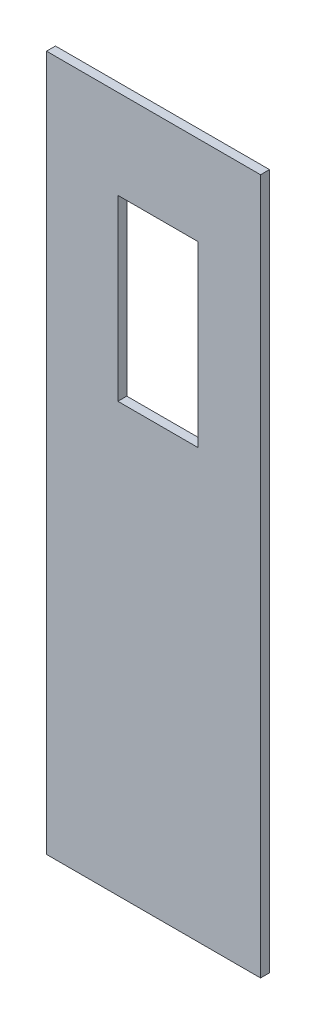
ISO-10303-21;
HEADER;
FILE_DESCRIPTION(('STEP AP214'),'2;1');
FILE_NAME('part.step','',(''),(''),'','','');
FILE_SCHEMA(('AUTOMOTIVE_DESIGN { 1 0 10303 214 1 1 1 1 }'));
ENDSEC;
DATA;
#1=APPLICATION_CONTEXT('core data for automotive mechanical design processes');
#2=APPLICATION_PROTOCOL_DEFINITION('international standard','automotive_design',2000,#1);
#3=PRODUCT_CONTEXT('',#1,'mechanical');
#4=PRODUCT('Part','Part','',(#3));
#5=PRODUCT_RELATED_PRODUCT_CATEGORY('part','',(#4));
#6=PRODUCT_DEFINITION_FORMATION('','',#4);
#7=PRODUCT_DEFINITION_CONTEXT('part definition',#1,'design');
#8=PRODUCT_DEFINITION('design','',#6,#7);
#9=PRODUCT_DEFINITION_SHAPE('','',#8);
#10=(LENGTH_UNIT() NAMED_UNIT(*) SI_UNIT(.MILLI.,.METRE.));
#11=(NAMED_UNIT(*) PLANE_ANGLE_UNIT() SI_UNIT($,.RADIAN.));
#12=(NAMED_UNIT(*) SI_UNIT($,.STERADIAN.) SOLID_ANGLE_UNIT());
#13=UNCERTAINTY_MEASURE_WITH_UNIT(LENGTH_MEASURE(1.E-05),#10,'distance_accuracy_value','');
#14=(GEOMETRIC_REPRESENTATION_CONTEXT(3) GLOBAL_UNCERTAINTY_ASSIGNED_CONTEXT((#13)) GLOBAL_UNIT_ASSIGNED_CONTEXT((#10,
#11,#12)) REPRESENTATION_CONTEXT('',''));
#15=CARTESIAN_POINT('',(0.,0.,0.));
#16=DIRECTION('',(0.,0.,1.));
#17=DIRECTION('',(1.,0.,0.));
#18=AXIS2_PLACEMENT_3D('',#15,#16,#17);
#19=CARTESIAN_POINT('',(0.,0.,5.));
#20=DIRECTION('',(0.,0.,1.));
#21=DIRECTION('',(1.,0.,0.));
#22=AXIS2_PLACEMENT_3D('',#19,#20,#21);
#23=PLANE('',#22);
#24=DIRECTION('',(0.,-1.,0.));
#25=VECTOR('',#24,1.);
#26=CARTESIAN_POINT('',(-61.0528045896396,64.6213031662228,5.));
#27=LINE('',#26,#25);
#28=CARTESIAN_POINT('',(-61.0528045896396,64.6213031662228,5.));
#29=VERTEX_POINT('',#28);
#30=CARTESIAN_POINT('',(-61.0528045896396,-325.378696833777,5.));
#31=VERTEX_POINT('',#30);
#32=EDGE_CURVE('E134',#29,#31,#27,.T.);
#33=ORIENTED_EDGE('',*,*,#32,.T.);
#34=DIRECTION('',(1.,0.,0.));
#35=VECTOR('',#34,1.);
#36=CARTESIAN_POINT('',(-61.0528045896396,-325.378696833777,5.));
#37=LINE('',#36,#35);
#38=CARTESIAN_POINT('',(58.9471954103604,-325.378696833777,5.));
#39=VERTEX_POINT('',#38);
#40=EDGE_CURVE('E137',#31,#39,#37,.T.);
#41=ORIENTED_EDGE('',*,*,#40,.T.);
#42=DIRECTION('',(0.,1.,0.));
#43=VECTOR('',#42,1.);
#44=CARTESIAN_POINT('',(58.9471954103604,64.6213031662228,5.));
#45=LINE('',#44,#43);
#46=CARTESIAN_POINT('',(58.9471954103604,64.6213031662228,5.));
#47=VERTEX_POINT('',#46);
#48=EDGE_CURVE('E140',#39,#47,#45,.T.);
#49=ORIENTED_EDGE('',*,*,#48,.T.);
#50=DIRECTION('',(-1.,0.,0.));
#51=VECTOR('',#50,1.);
#52=CARTESIAN_POINT('',(-61.0528045896396,64.6213031662228,5.));
#53=LINE('',#52,#51);
#54=EDGE_CURVE('E142',#47,#29,#53,.T.);
#55=ORIENTED_EDGE('',*,*,#54,.T.);
#56=EDGE_LOOP('',(#33,#41,#49,#55));
#57=FACE_BOUND('',#56,.T.);
#58=DIRECTION('',(1.,0.,0.));
#59=VECTOR('',#58,1.);
#60=CARTESIAN_POINT('',(-21.0528045896396,-85.3786968337772,5.));
#61=LINE('',#60,#59);
#62=CARTESIAN_POINT('',(-21.0528045896396,-85.3786968337772,5.));
#63=VERTEX_POINT('',#62);
#64=CARTESIAN_POINT('',(23.9471954103604,-85.3786968337772,5.));
#65=VERTEX_POINT('',#64);
#66=EDGE_CURVE('E106',#63,#65,#61,.T.);
#67=ORIENTED_EDGE('',*,*,#66,.F.);
#68=DIRECTION('',(0.,-1.,0.));
#69=VECTOR('',#68,1.);
#70=CARTESIAN_POINT('',(-21.0528045896396,-85.3786968337772,5.));
#71=LINE('',#70,#69);
#72=CARTESIAN_POINT('',(-21.0528045896396,14.6213031662228,5.));
#73=VERTEX_POINT('',#72);
#74=EDGE_CURVE('E98',#73,#63,#71,.T.);
#75=ORIENTED_EDGE('',*,*,#74,.F.);
#76=DIRECTION('',(-1.,0.,0.));
#77=VECTOR('',#76,1.);
#78=CARTESIAN_POINT('',(-21.0528045896396,14.6213031662228,5.));
#79=LINE('',#78,#77);
#80=CARTESIAN_POINT('',(23.9471954103604,14.6213031662228,5.));
#81=VERTEX_POINT('',#80);
#82=EDGE_CURVE('E120',#81,#73,#79,.T.);
#83=ORIENTED_EDGE('',*,*,#82,.F.);
#84=DIRECTION('',(0.,1.,0.));
#85=VECTOR('',#84,1.);
#86=CARTESIAN_POINT('',(23.9471954103604,-85.3786968337772,5.));
#87=LINE('',#86,#85);
#88=EDGE_CURVE('E118',#65,#81,#87,.T.);
#89=ORIENTED_EDGE('',*,*,#88,.F.);
#90=EDGE_LOOP('',(#67,#75,#83,#89));
#91=FACE_BOUND('',#90,.T.);
#92=ADVANCED_FACE('F33',(#57,#91),#23,.T.);
#93=CARTESIAN_POINT('',(0.,0.,0.));
#94=DIRECTION('',(0.,0.,1.));
#95=DIRECTION('',(1.,0.,0.));
#96=AXIS2_PLACEMENT_3D('',#93,#94,#95);
#97=PLANE('',#96);
#98=DIRECTION('',(0.,-1.,0.));
#99=VECTOR('',#98,1.);
#100=CARTESIAN_POINT('',(-61.0528045896396,64.6213031662228,0.));
#101=LINE('',#100,#99);
#102=CARTESIAN_POINT('',(-61.0528045896396,64.6213031662228,0.));
#103=VERTEX_POINT('',#102);
#104=CARTESIAN_POINT('',(-61.0528045896396,-325.378696833777,0.));
#105=VERTEX_POINT('',#104);
#106=EDGE_CURVE('E114',#103,#105,#101,.T.);
#107=ORIENTED_EDGE('',*,*,#106,.F.);
#108=DIRECTION('',(-1.,0.,0.));
#109=VECTOR('',#108,1.);
#110=CARTESIAN_POINT('',(-61.0528045896396,64.6213031662228,0.));
#111=LINE('',#110,#109);
#112=CARTESIAN_POINT('',(58.9471954103604,64.6213031662228,0.));
#113=VERTEX_POINT('',#112);
#114=EDGE_CURVE('E138',#113,#103,#111,.T.);
#115=ORIENTED_EDGE('',*,*,#114,.F.);
#116=DIRECTION('',(0.,1.,0.));
#117=VECTOR('',#116,1.);
#118=CARTESIAN_POINT('',(58.9471954103604,64.6213031662228,0.));
#119=LINE('',#118,#117);
#120=CARTESIAN_POINT('',(58.9471954103604,-325.378696833777,0.));
#121=VERTEX_POINT('',#120);
#122=EDGE_CURVE('E149',#121,#113,#119,.T.);
#123=ORIENTED_EDGE('',*,*,#122,.F.);
#124=DIRECTION('',(1.,0.,0.));
#125=VECTOR('',#124,1.);
#126=CARTESIAN_POINT('',(-61.0528045896396,-325.378696833777,0.));
#127=LINE('',#126,#125);
#128=EDGE_CURVE('E147',#105,#121,#127,.T.);
#129=ORIENTED_EDGE('',*,*,#128,.F.);
#130=EDGE_LOOP('',(#107,#115,#123,#129));
#131=FACE_BOUND('',#130,.T.);
#132=DIRECTION('',(0.,-1.,0.));
#133=VECTOR('',#132,1.);
#134=CARTESIAN_POINT('',(-21.0528045896396,-85.3786968337772,0.));
#135=LINE('',#134,#133);
#136=CARTESIAN_POINT('',(-21.0528045896396,14.6213031662228,0.));
#137=VERTEX_POINT('',#136);
#138=CARTESIAN_POINT('',(-21.0528045896396,-85.3786968337772,0.));
#139=VERTEX_POINT('',#138);
#140=EDGE_CURVE('E56',#137,#139,#135,.T.);
#141=ORIENTED_EDGE('',*,*,#140,.T.);
#142=DIRECTION('',(1.,0.,0.));
#143=VECTOR('',#142,1.);
#144=CARTESIAN_POINT('',(-21.0528045896396,-85.3786968337772,0.));
#145=LINE('',#144,#143);
#146=CARTESIAN_POINT('',(23.9471954103604,-85.3786968337772,0.));
#147=VERTEX_POINT('',#146);
#148=EDGE_CURVE('E113',#139,#147,#145,.T.);
#149=ORIENTED_EDGE('',*,*,#148,.T.);
#150=DIRECTION('',(0.,1.,0.));
#151=VECTOR('',#150,1.);
#152=CARTESIAN_POINT('',(23.9471954103604,-85.3786968337772,0.));
#153=LINE('',#152,#151);
#154=CARTESIAN_POINT('',(23.9471954103604,14.6213031662228,0.));
#155=VERTEX_POINT('',#154);
#156=EDGE_CURVE('E126',#147,#155,#153,.T.);
#157=ORIENTED_EDGE('',*,*,#156,.T.);
#158=DIRECTION('',(-1.,0.,0.));
#159=VECTOR('',#158,1.);
#160=CARTESIAN_POINT('',(-21.0528045896396,14.6213031662228,0.));
#161=LINE('',#160,#159);
#162=EDGE_CURVE('E107',#155,#137,#161,.T.);
#163=ORIENTED_EDGE('',*,*,#162,.T.);
#164=EDGE_LOOP('',(#141,#149,#157,#163));
#165=FACE_BOUND('',#164,.T.);
#166=ADVANCED_FACE('F167',(#131,#165),#97,.F.);
#167=CARTESIAN_POINT('',(-61.0528045896396,64.6213031662228,5.));
#168=DIRECTION('',(1.,0.,0.));
#169=DIRECTION('',(0.,1.,0.));
#170=AXIS2_PLACEMENT_3D('',#167,#168,#169);
#171=PLANE('',#170);
#172=ORIENTED_EDGE('',*,*,#106,.T.);
#173=DIRECTION('',(0.,0.,-1.));
#174=VECTOR('',#173,1.);
#175=CARTESIAN_POINT('',(-61.0528045896396,-325.378696833777,5.));
#176=LINE('',#175,#174);
#177=EDGE_CURVE('E11',#31,#105,#176,.T.);
#178=ORIENTED_EDGE('',*,*,#177,.F.);
#179=ORIENTED_EDGE('',*,*,#32,.F.);
#180=DIRECTION('',(0.,0.,-1.));
#181=VECTOR('',#180,1.);
#182=CARTESIAN_POINT('',(-61.0528045896396,64.6213031662228,5.));
#183=LINE('',#182,#181);
#184=EDGE_CURVE('E144',#29,#103,#183,.T.);
#185=ORIENTED_EDGE('',*,*,#184,.T.);
#186=EDGE_LOOP('',(#172,#178,#179,#185));
#187=FACE_BOUND('',#186,.T.);
#188=ADVANCED_FACE('F35',(#187),#171,.F.);
#189=CARTESIAN_POINT('',(-61.0528045896396,-325.378696833777,5.));
#190=DIRECTION('',(0.,1.,0.));
#191=DIRECTION('',(0.,0.,1.));
#192=AXIS2_PLACEMENT_3D('',#189,#190,#191);
#193=PLANE('',#192);
#194=ORIENTED_EDGE('',*,*,#128,.T.);
#195=DIRECTION('',(0.,0.,-1.));
#196=VECTOR('',#195,1.);
#197=CARTESIAN_POINT('',(58.9471954103604,-325.378696833777,5.));
#198=LINE('',#197,#196);
#199=EDGE_CURVE('E41',#39,#121,#198,.T.);
#200=ORIENTED_EDGE('',*,*,#199,.F.);
#201=ORIENTED_EDGE('',*,*,#40,.F.);
#202=ORIENTED_EDGE('',*,*,#177,.T.);
#203=EDGE_LOOP('',(#194,#200,#201,#202));
#204=FACE_BOUND('',#203,.T.);
#205=ADVANCED_FACE('F177',(#204),#193,.F.);
#206=CARTESIAN_POINT('',(58.9471954103604,64.6213031662228,5.));
#207=DIRECTION('',(-1.,0.,0.));
#208=DIRECTION('',(0.,-1.,0.));
#209=AXIS2_PLACEMENT_3D('',#206,#207,#208);
#210=PLANE('',#209);
#211=ORIENTED_EDGE('',*,*,#122,.T.);
#212=DIRECTION('',(0.,0.,-1.));
#213=VECTOR('',#212,1.);
#214=CARTESIAN_POINT('',(58.9471954103604,64.6213031662228,5.));
#215=LINE('',#214,#213);
#216=EDGE_CURVE('E154',#47,#113,#215,.T.);
#217=ORIENTED_EDGE('',*,*,#216,.F.);
#218=ORIENTED_EDGE('',*,*,#48,.F.);
#219=ORIENTED_EDGE('',*,*,#199,.T.);
#220=EDGE_LOOP('',(#211,#217,#218,#219));
#221=FACE_BOUND('',#220,.T.);
#222=ADVANCED_FACE('F161',(#221),#210,.F.);
#223=CARTESIAN_POINT('',(-61.0528045896396,64.6213031662228,5.));
#224=DIRECTION('',(0.,-1.,0.));
#225=DIRECTION('',(0.,0.,-1.));
#226=AXIS2_PLACEMENT_3D('',#223,#224,#225);
#227=PLANE('',#226);
#228=ORIENTED_EDGE('',*,*,#114,.T.);
#229=ORIENTED_EDGE('',*,*,#184,.F.);
#230=ORIENTED_EDGE('',*,*,#54,.F.);
#231=ORIENTED_EDGE('',*,*,#216,.T.);
#232=EDGE_LOOP('',(#228,#229,#230,#231));
#233=FACE_BOUND('',#232,.T.);
#234=ADVANCED_FACE('F171',(#233),#227,.F.);
#235=CARTESIAN_POINT('',(-21.0528045896396,-85.3786968337772,5.));
#236=DIRECTION('',(1.,0.,0.));
#237=DIRECTION('',(0.,0.,-1.));
#238=AXIS2_PLACEMENT_3D('',#235,#236,#237);
#239=PLANE('',#238);
#240=ORIENTED_EDGE('',*,*,#140,.F.);
#241=DIRECTION('',(0.,0.,-1.));
#242=VECTOR('',#241,1.);
#243=CARTESIAN_POINT('',(-21.0528045896396,14.6213031662228,5.));
#244=LINE('',#243,#242);
#245=EDGE_CURVE('E102',#73,#137,#244,.T.);
#246=ORIENTED_EDGE('',*,*,#245,.F.);
#247=ORIENTED_EDGE('',*,*,#74,.T.);
#248=DIRECTION('',(0.,0.,-1.));
#249=VECTOR('',#248,1.);
#250=CARTESIAN_POINT('',(-21.0528045896396,-85.3786968337772,5.));
#251=LINE('',#250,#249);
#252=EDGE_CURVE('E101',#63,#139,#251,.T.);
#253=ORIENTED_EDGE('',*,*,#252,.T.);
#254=EDGE_LOOP('',(#240,#246,#247,#253));
#255=FACE_BOUND('',#254,.T.);
#256=ADVANCED_FACE('F100',(#255),#239,.T.);
#257=CARTESIAN_POINT('',(-21.0528045896396,-85.3786968337772,5.));
#258=DIRECTION('',(0.,1.,0.));
#259=DIRECTION('',(0.,0.,1.));
#260=AXIS2_PLACEMENT_3D('',#257,#258,#259);
#261=PLANE('',#260);
#262=ORIENTED_EDGE('',*,*,#148,.F.);
#263=ORIENTED_EDGE('',*,*,#252,.F.);
#264=ORIENTED_EDGE('',*,*,#66,.T.);
#265=DIRECTION('',(0.,0.,-1.));
#266=VECTOR('',#265,1.);
#267=CARTESIAN_POINT('',(23.9471954103604,-85.3786968337772,5.));
#268=LINE('',#267,#266);
#269=EDGE_CURVE('E115',#65,#147,#268,.T.);
#270=ORIENTED_EDGE('',*,*,#269,.T.);
#271=EDGE_LOOP('',(#262,#263,#264,#270));
#272=FACE_BOUND('',#271,.T.);
#273=ADVANCED_FACE('F110',(#272),#261,.T.);
#274=CARTESIAN_POINT('',(23.9471954103604,-85.3786968337772,5.));
#275=DIRECTION('',(-1.,0.,0.));
#276=DIRECTION('',(0.,0.,1.));
#277=AXIS2_PLACEMENT_3D('',#274,#275,#276);
#278=PLANE('',#277);
#279=ORIENTED_EDGE('',*,*,#156,.F.);
#280=ORIENTED_EDGE('',*,*,#269,.F.);
#281=ORIENTED_EDGE('',*,*,#88,.T.);
#282=DIRECTION('',(0.,0.,-1.));
#283=VECTOR('',#282,1.);
#284=CARTESIAN_POINT('',(23.9471954103604,14.6213031662228,5.));
#285=LINE('',#284,#283);
#286=EDGE_CURVE('E48',#81,#155,#285,.T.);
#287=ORIENTED_EDGE('',*,*,#286,.T.);
#288=EDGE_LOOP('',(#279,#280,#281,#287));
#289=FACE_BOUND('',#288,.T.);
#290=ADVANCED_FACE('F200',(#289),#278,.T.);
#291=CARTESIAN_POINT('',(-21.0528045896396,14.6213031662228,5.));
#292=DIRECTION('',(0.,-1.,0.));
#293=DIRECTION('',(0.,0.,-1.));
#294=AXIS2_PLACEMENT_3D('',#291,#292,#293);
#295=PLANE('',#294);
#296=ORIENTED_EDGE('',*,*,#162,.F.);
#297=ORIENTED_EDGE('',*,*,#286,.F.);
#298=ORIENTED_EDGE('',*,*,#82,.T.);
#299=ORIENTED_EDGE('',*,*,#245,.T.);
#300=EDGE_LOOP('',(#296,#297,#298,#299));
#301=FACE_BOUND('',#300,.T.);
#302=ADVANCED_FACE('F204',(#301),#295,.T.);
#303=CLOSED_SHELL('',(#92,#166,#188,#205,#222,#234,#256,#273,#290,#302));
#304=MANIFOLD_SOLID_BREP('B2',#303);
#305=ADVANCED_BREP_SHAPE_REPRESENTATION('',(#18,#304),#14);
#306=SHAPE_DEFINITION_REPRESENTATION(#9,#305);
ENDSEC;
END-ISO-10303-21;
